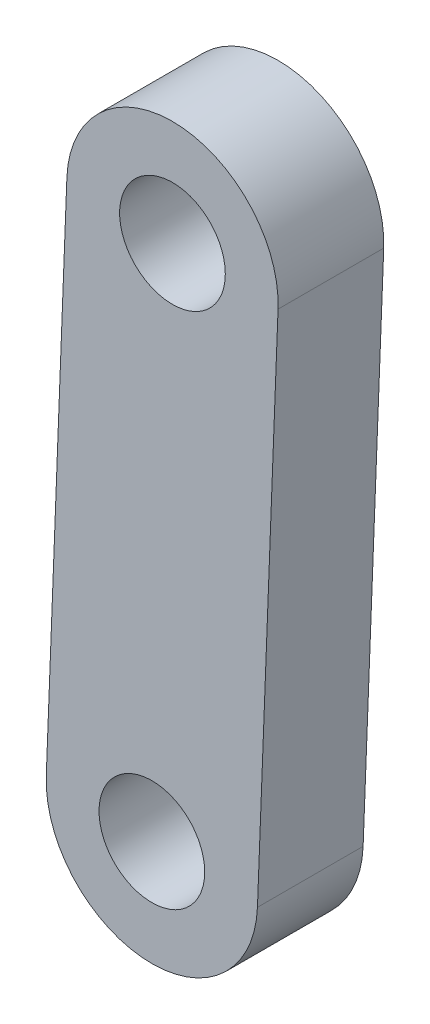
ISO-10303-21;
HEADER;
FILE_DESCRIPTION(('STEP AP214'),'2;1');
FILE_NAME('part.step','',(''),(''),'','','');
FILE_SCHEMA(('AUTOMOTIVE_DESIGN { 1 0 10303 214 1 1 1 1 }'));
ENDSEC;
DATA;
#1=APPLICATION_CONTEXT('core data for automotive mechanical design processes');
#2=APPLICATION_PROTOCOL_DEFINITION('international standard','automotive_design',2000,#1);
#3=PRODUCT_CONTEXT('',#1,'mechanical');
#4=PRODUCT('Part','Part','',(#3));
#5=PRODUCT_RELATED_PRODUCT_CATEGORY('part','',(#4));
#6=PRODUCT_DEFINITION_FORMATION('','',#4);
#7=PRODUCT_DEFINITION_CONTEXT('part definition',#1,'design');
#8=PRODUCT_DEFINITION('design','',#6,#7);
#9=PRODUCT_DEFINITION_SHAPE('','',#8);
#10=(LENGTH_UNIT() NAMED_UNIT(*) SI_UNIT(.MILLI.,.METRE.));
#11=(NAMED_UNIT(*) PLANE_ANGLE_UNIT() SI_UNIT($,.RADIAN.));
#12=(NAMED_UNIT(*) SI_UNIT($,.STERADIAN.) SOLID_ANGLE_UNIT());
#13=UNCERTAINTY_MEASURE_WITH_UNIT(LENGTH_MEASURE(1.E-05),#10,'distance_accuracy_value','');
#14=(GEOMETRIC_REPRESENTATION_CONTEXT(3) GLOBAL_UNCERTAINTY_ASSIGNED_CONTEXT((#13)) GLOBAL_UNIT_ASSIGNED_CONTEXT((#10,
#11,#12)) REPRESENTATION_CONTEXT('',''));
#15=CARTESIAN_POINT('',(0.,0.,0.));
#16=DIRECTION('',(0.,0.,1.));
#17=DIRECTION('',(1.,0.,0.));
#18=AXIS2_PLACEMENT_3D('',#15,#16,#17);
#19=CARTESIAN_POINT('',(0.,0.,10.));
#20=DIRECTION('',(0.,0.,1.));
#21=DIRECTION('',(1.,0.,0.));
#22=AXIS2_PLACEMENT_3D('',#19,#20,#21);
#23=PLANE('',#22);
#24=CARTESIAN_POINT('',(-1.94916067146284,-50.,10.));
#25=DIRECTION('',(0.,0.,1.));
#26=DIRECTION('',(1.,0.,0.));
#27=AXIS2_PLACEMENT_3D('',#24,#25,#26);
#28=CIRCLE('',#27,5.);
#29=CARTESIAN_POINT('',(3.05083932853717,-50.,10.));
#30=VERTEX_POINT('',#29);
#31=EDGE_CURVE('E100',#30,#30,#28,.T.);
#32=ORIENTED_EDGE('',*,*,#31,.F.);
#33=EDGE_LOOP('',(#32));
#34=FACE_BOUND('',#33,.T.);
#35=CARTESIAN_POINT('',(0.,0.,10.));
#36=DIRECTION('',(0.,0.,1.));
#37=DIRECTION('',(1.,0.,0.));
#38=AXIS2_PLACEMENT_3D('',#35,#36,#37);
#39=CIRCLE('',#38,9.99999999999998);
#40=CARTESIAN_POINT('',(9.99241019487744,-0.389536259299588,10.));
#41=VERTEX_POINT('',#40);
#42=CARTESIAN_POINT('',(-9.99241019487743,0.389536259299588,10.));
#43=VERTEX_POINT('',#42);
#44=EDGE_CURVE('E85',#41,#43,#39,.T.);
#45=ORIENTED_EDGE('',*,*,#44,.T.);
#46=DIRECTION('',(-0.0389536259299588,-0.999241019487745,0.));
#47=VECTOR('',#46,1.);
#48=CARTESIAN_POINT('',(-9.99241019487743,0.389536259299588,10.));
#49=LINE('',#48,#47);
#50=CARTESIAN_POINT('',(-11.9415708663403,-49.6104637407004,10.));
#51=VERTEX_POINT('',#50);
#52=EDGE_CURVE('E80',#43,#51,#49,.T.);
#53=ORIENTED_EDGE('',*,*,#52,.T.);
#54=CARTESIAN_POINT('',(-1.94916067146284,-50.,10.));
#55=DIRECTION('',(0.,0.,1.));
#56=DIRECTION('',(1.,0.,0.));
#57=AXIS2_PLACEMENT_3D('',#54,#55,#56);
#58=CIRCLE('',#57,9.99999999999998);
#59=CARTESIAN_POINT('',(8.04324952341461,-50.3895362592996,10.));
#60=VERTEX_POINT('',#59);
#61=EDGE_CURVE('E83',#51,#60,#58,.T.);
#62=ORIENTED_EDGE('',*,*,#61,.T.);
#63=DIRECTION('',(0.0389536259299588,0.999241019487745,0.));
#64=VECTOR('',#63,1.);
#65=CARTESIAN_POINT('',(9.99241019487744,-0.389536259299588,10.));
#66=LINE('',#65,#64);
#67=EDGE_CURVE('E50',#60,#41,#66,.T.);
#68=ORIENTED_EDGE('',*,*,#67,.T.);
#69=EDGE_LOOP('',(#45,#53,#62,#68));
#70=FACE_BOUND('',#69,.T.);
#71=CARTESIAN_POINT('',(0.,0.,10.));
#72=DIRECTION('',(0.,0.,1.));
#73=DIRECTION('',(1.,0.,0.));
#74=AXIS2_PLACEMENT_3D('',#71,#72,#73);
#75=CIRCLE('',#74,5.);
#76=CARTESIAN_POINT('',(5.,0.,10.));
#77=VERTEX_POINT('',#76);
#78=EDGE_CURVE('E115',#77,#77,#75,.T.);
#79=ORIENTED_EDGE('',*,*,#78,.F.);
#80=EDGE_LOOP('',(#79));
#81=FACE_BOUND('',#80,.T.);
#82=ADVANCED_FACE('F33',(#34,#70,#81),#23,.T.);
#83=CARTESIAN_POINT('',(0.,0.,0.));
#84=DIRECTION('',(0.,0.,1.));
#85=DIRECTION('',(1.,0.,0.));
#86=AXIS2_PLACEMENT_3D('',#83,#84,#85);
#87=PLANE('',#86);
#88=CARTESIAN_POINT('',(0.,0.,0.));
#89=DIRECTION('',(0.,0.,1.));
#90=DIRECTION('',(1.,0.,0.));
#91=AXIS2_PLACEMENT_3D('',#88,#89,#90);
#92=CIRCLE('',#91,9.99999999999998);
#93=CARTESIAN_POINT('',(9.99241019487744,-0.389536259299588,0.));
#94=VERTEX_POINT('',#93);
#95=CARTESIAN_POINT('',(-9.99241019487743,0.389536259299588,0.));
#96=VERTEX_POINT('',#95);
#97=EDGE_CURVE('E97',#94,#96,#92,.T.);
#98=ORIENTED_EDGE('',*,*,#97,.F.);
#99=DIRECTION('',(0.0389536259299588,0.999241019487745,0.));
#100=VECTOR('',#99,1.);
#101=CARTESIAN_POINT('',(9.99241019487744,-0.389536259299588,0.));
#102=LINE('',#101,#100);
#103=CARTESIAN_POINT('',(8.04324952341461,-50.3895362592996,0.));
#104=VERTEX_POINT('',#103);
#105=EDGE_CURVE('E73',#104,#94,#102,.T.);
#106=ORIENTED_EDGE('',*,*,#105,.F.);
#107=CARTESIAN_POINT('',(-1.94916067146284,-50.,0.));
#108=DIRECTION('',(0.,0.,1.));
#109=DIRECTION('',(1.,0.,0.));
#110=AXIS2_PLACEMENT_3D('',#107,#108,#109);
#111=CIRCLE('',#110,9.99999999999998);
#112=CARTESIAN_POINT('',(-11.9415708663403,-49.6104637407004,0.));
#113=VERTEX_POINT('',#112);
#114=EDGE_CURVE('E67',#113,#104,#111,.T.);
#115=ORIENTED_EDGE('',*,*,#114,.F.);
#116=DIRECTION('',(-0.0389536259299588,-0.999241019487745,0.));
#117=VECTOR('',#116,1.);
#118=CARTESIAN_POINT('',(-9.99241019487743,0.389536259299588,0.));
#119=LINE('',#118,#117);
#120=EDGE_CURVE('E89',#96,#113,#119,.T.);
#121=ORIENTED_EDGE('',*,*,#120,.F.);
#122=EDGE_LOOP('',(#98,#106,#115,#121));
#123=FACE_BOUND('',#122,.T.);
#124=CARTESIAN_POINT('',(-1.94916067146284,-50.,0.));
#125=DIRECTION('',(0.,0.,1.));
#126=DIRECTION('',(1.,0.,0.));
#127=AXIS2_PLACEMENT_3D('',#124,#125,#126);
#128=CIRCLE('',#127,5.);
#129=CARTESIAN_POINT('',(3.05083932853717,-50.,0.));
#130=VERTEX_POINT('',#129);
#131=EDGE_CURVE('E112',#130,#130,#128,.T.);
#132=ORIENTED_EDGE('',*,*,#131,.T.);
#133=EDGE_LOOP('',(#132));
#134=FACE_BOUND('',#133,.T.);
#135=CARTESIAN_POINT('',(0.,0.,0.));
#136=DIRECTION('',(0.,0.,1.));
#137=DIRECTION('',(1.,0.,0.));
#138=AXIS2_PLACEMENT_3D('',#135,#136,#137);
#139=CIRCLE('',#138,5.);
#140=CARTESIAN_POINT('',(5.,0.,0.));
#141=VERTEX_POINT('',#140);
#142=EDGE_CURVE('E118',#141,#141,#139,.T.);
#143=ORIENTED_EDGE('',*,*,#142,.T.);
#144=EDGE_LOOP('',(#143));
#145=FACE_BOUND('',#144,.T.);
#146=ADVANCED_FACE('F108',(#123,#134,#145),#87,.F.);
#147=CARTESIAN_POINT('',(0.,0.,10.));
#148=DIRECTION('',(0.,0.,-1.));
#149=DIRECTION('',(-1.,0.,0.));
#150=AXIS2_PLACEMENT_3D('',#147,#148,#149);
#151=CYLINDRICAL_SURFACE('',#150,9.99999999999998);
#152=ORIENTED_EDGE('',*,*,#97,.T.);
#153=DIRECTION('',(0.,0.,-1.));
#154=VECTOR('',#153,1.);
#155=CARTESIAN_POINT('',(-9.99241019487743,0.389536259299588,10.));
#156=LINE('',#155,#154);
#157=EDGE_CURVE('E11',#43,#96,#156,.T.);
#158=ORIENTED_EDGE('',*,*,#157,.F.);
#159=ORIENTED_EDGE('',*,*,#44,.F.);
#160=DIRECTION('',(0.,0.,-1.));
#161=VECTOR('',#160,1.);
#162=CARTESIAN_POINT('',(9.99241019487744,-0.389536259299588,10.));
#163=LINE('',#162,#161);
#164=EDGE_CURVE('E93',#41,#94,#163,.T.);
#165=ORIENTED_EDGE('',*,*,#164,.T.);
#166=EDGE_LOOP('',(#152,#158,#159,#165));
#167=FACE_BOUND('',#166,.T.);
#168=ADVANCED_FACE('F35',(#167),#151,.T.);
#169=CARTESIAN_POINT('',(-9.99241019487743,0.389536259299588,10.));
#170=DIRECTION('',(0.999241019487745,-0.0389536259299588,0.));
#171=DIRECTION('',(0.0389536259299588,0.999241019487745,0.));
#172=AXIS2_PLACEMENT_3D('',#169,#170,#171);
#173=PLANE('',#172);
#174=ORIENTED_EDGE('',*,*,#120,.T.);
#175=DIRECTION('',(0.,0.,-1.));
#176=VECTOR('',#175,1.);
#177=CARTESIAN_POINT('',(-11.9415708663403,-49.6104637407004,10.));
#178=LINE('',#177,#176);
#179=EDGE_CURVE('E42',#51,#113,#178,.T.);
#180=ORIENTED_EDGE('',*,*,#179,.F.);
#181=ORIENTED_EDGE('',*,*,#52,.F.);
#182=ORIENTED_EDGE('',*,*,#157,.T.);
#183=EDGE_LOOP('',(#174,#180,#181,#182));
#184=FACE_BOUND('',#183,.T.);
#185=ADVANCED_FACE('F88',(#184),#173,.F.);
#186=CARTESIAN_POINT('',(-1.94916067146284,-50.,10.));
#187=DIRECTION('',(0.,0.,-1.));
#188=DIRECTION('',(-1.,0.,0.));
#189=AXIS2_PLACEMENT_3D('',#186,#187,#188);
#190=CYLINDRICAL_SURFACE('',#189,9.99999999999998);
#191=ORIENTED_EDGE('',*,*,#114,.T.);
#192=DIRECTION('',(0.,0.,-1.));
#193=VECTOR('',#192,1.);
#194=CARTESIAN_POINT('',(8.04324952341461,-50.3895362592996,10.));
#195=LINE('',#194,#193);
#196=EDGE_CURVE('E90',#60,#104,#195,.T.);
#197=ORIENTED_EDGE('',*,*,#196,.F.);
#198=ORIENTED_EDGE('',*,*,#61,.F.);
#199=ORIENTED_EDGE('',*,*,#179,.T.);
#200=EDGE_LOOP('',(#191,#197,#198,#199));
#201=FACE_BOUND('',#200,.T.);
#202=ADVANCED_FACE('F91',(#201),#190,.T.);
#203=CARTESIAN_POINT('',(9.99241019487744,-0.389536259299588,10.));
#204=DIRECTION('',(-0.999241019487745,0.0389536259299588,0.));
#205=DIRECTION('',(-0.0389536259299588,-0.999241019487745,0.));
#206=AXIS2_PLACEMENT_3D('',#203,#204,#205);
#207=PLANE('',#206);
#208=ORIENTED_EDGE('',*,*,#105,.T.);
#209=ORIENTED_EDGE('',*,*,#164,.F.);
#210=ORIENTED_EDGE('',*,*,#67,.F.);
#211=ORIENTED_EDGE('',*,*,#196,.T.);
#212=EDGE_LOOP('',(#208,#209,#210,#211));
#213=FACE_BOUND('',#212,.T.);
#214=ADVANCED_FACE('F105',(#213),#207,.F.);
#215=CARTESIAN_POINT('',(-1.94916067146284,-50.,10.));
#216=DIRECTION('',(0.,0.,-1.));
#217=DIRECTION('',(-1.,0.,0.));
#218=AXIS2_PLACEMENT_3D('',#215,#216,#217);
#219=CYLINDRICAL_SURFACE('',#218,5.);
#220=ORIENTED_EDGE('',*,*,#31,.T.);
#221=EDGE_LOOP('',(#220));
#222=FACE_BOUND('',#221,.T.);
#223=ORIENTED_EDGE('',*,*,#131,.F.);
#224=EDGE_LOOP('',(#223));
#225=FACE_BOUND('',#224,.T.);
#226=ADVANCED_FACE('F135',(#222,#225),#219,.F.);
#227=CARTESIAN_POINT('',(0.,0.,10.));
#228=DIRECTION('',(0.,0.,-1.));
#229=DIRECTION('',(-1.,0.,0.));
#230=AXIS2_PLACEMENT_3D('',#227,#228,#229);
#231=CYLINDRICAL_SURFACE('',#230,5.);
#232=ORIENTED_EDGE('',*,*,#78,.T.);
#233=EDGE_LOOP('',(#232));
#234=FACE_BOUND('',#233,.T.);
#235=ORIENTED_EDGE('',*,*,#142,.F.);
#236=EDGE_LOOP('',(#235));
#237=FACE_BOUND('',#236,.T.);
#238=ADVANCED_FACE('F124',(#234,#237),#231,.F.);
#239=CLOSED_SHELL('',(#82,#146,#168,#185,#202,#214,#226,#238));
#240=MANIFOLD_SOLID_BREP('B2',#239);
#241=ADVANCED_BREP_SHAPE_REPRESENTATION('',(#18,#240),#14);
#242=SHAPE_DEFINITION_REPRESENTATION(#9,#241);
ENDSEC;
END-ISO-10303-21;
